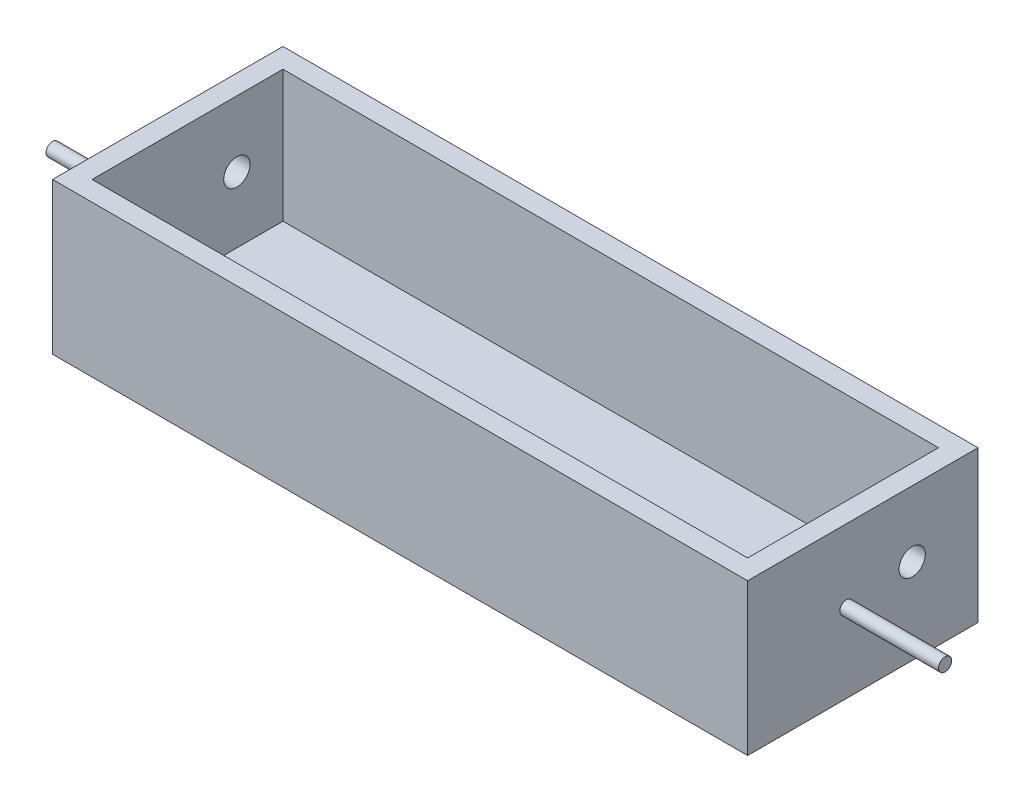
ISO-10303-21;
HEADER;
FILE_DESCRIPTION(('STEP AP214'),'2;1');
FILE_NAME('part.step','',(''),(''),'','','');
FILE_SCHEMA(('AUTOMOTIVE_DESIGN { 1 0 10303 214 1 1 1 1 }'));
ENDSEC;
DATA;
#1=APPLICATION_CONTEXT('core data for automotive mechanical design processes');
#2=APPLICATION_PROTOCOL_DEFINITION('international standard','automotive_design',2000,#1);
#3=PRODUCT_CONTEXT('',#1,'mechanical');
#4=PRODUCT('Part','Part','',(#3));
#5=PRODUCT_RELATED_PRODUCT_CATEGORY('part','',(#4));
#6=PRODUCT_DEFINITION_FORMATION('','',#4);
#7=PRODUCT_DEFINITION_CONTEXT('part definition',#1,'design');
#8=PRODUCT_DEFINITION('design','',#6,#7);
#9=PRODUCT_DEFINITION_SHAPE('','',#8);
#10=(LENGTH_UNIT() NAMED_UNIT(*) SI_UNIT(.MILLI.,.METRE.));
#11=(NAMED_UNIT(*) PLANE_ANGLE_UNIT() SI_UNIT($,.RADIAN.));
#12=(NAMED_UNIT(*) SI_UNIT($,.STERADIAN.) SOLID_ANGLE_UNIT());
#13=UNCERTAINTY_MEASURE_WITH_UNIT(LENGTH_MEASURE(1.E-05),#10,'distance_accuracy_value','');
#14=(GEOMETRIC_REPRESENTATION_CONTEXT(3) GLOBAL_UNCERTAINTY_ASSIGNED_CONTEXT((#13)) GLOBAL_UNIT_ASSIGNED_CONTEXT((#10,
#11,#12)) REPRESENTATION_CONTEXT('',''));
#15=CARTESIAN_POINT('',(0.,0.,0.));
#16=DIRECTION('',(0.,0.,1.));
#17=DIRECTION('',(1.,0.,0.));
#18=AXIS2_PLACEMENT_3D('',#15,#16,#17);
#19=CARTESIAN_POINT('',(52.8,3.,0.));
#20=DIRECTION('',(-1.,0.,0.));
#21=DIRECTION('',(0.,0.,1.));
#22=AXIS2_PLACEMENT_3D('',#19,#20,#21);
#23=PLANE('',#22);
#24=CARTESIAN_POINT('',(52.8,12.,10.));
#25=DIRECTION('',(-1.,0.,0.));
#26=DIRECTION('',(0.,0.,1.));
#27=AXIS2_PLACEMENT_3D('',#24,#25,#26);
#28=CIRCLE('',#27,1.);
#29=CARTESIAN_POINT('',(52.8,12.,11.));
#30=VERTEX_POINT('',#29);
#31=EDGE_CURVE('E197',#30,#30,#28,.T.);
#32=ORIENTED_EDGE('',*,*,#31,.T.);
#33=EDGE_LOOP('',(#32));
#34=FACE_BOUND('',#33,.T.);
#35=CARTESIAN_POINT('',(52.8,13.,0.));
#36=DIRECTION('',(-1.,0.,0.));
#37=DIRECTION('',(0.,0.,1.));
#38=AXIS2_PLACEMENT_3D('',#35,#36,#37);
#39=CIRCLE('',#38,2.);
#40=CARTESIAN_POINT('',(52.8,13.,2.));
#41=VERTEX_POINT('',#40);
#42=EDGE_CURVE('E112',#41,#41,#39,.T.);
#43=ORIENTED_EDGE('',*,*,#42,.T.);
#44=EDGE_LOOP('',(#43));
#45=FACE_BOUND('',#44,.T.);
#46=DIRECTION('',(0.,0.,-1.));
#47=VECTOR('',#46,1.);
#48=CARTESIAN_POINT('',(52.8,0.,0.));
#49=LINE('',#48,#47);
#50=CARTESIAN_POINT('',(52.8,0.,25.));
#51=VERTEX_POINT('',#50);
#52=CARTESIAN_POINT('',(52.8,0.,-9.99999999999999));
#53=VERTEX_POINT('',#52);
#54=EDGE_CURVE('E174',#51,#53,#49,.T.);
#55=ORIENTED_EDGE('',*,*,#54,.T.);
#56=DIRECTION('',(0.,-1.,0.));
#57=VECTOR('',#56,1.);
#58=CARTESIAN_POINT('',(52.8,3.,-9.99999999999999));
#59=LINE('',#58,#57);
#60=CARTESIAN_POINT('',(52.8,23.,-9.99999999999999));
#61=VERTEX_POINT('',#60);
#62=EDGE_CURVE('E48',#61,#53,#59,.T.);
#63=ORIENTED_EDGE('',*,*,#62,.F.);
#64=DIRECTION('',(0.,0.,-1.));
#65=VECTOR('',#64,1.);
#66=CARTESIAN_POINT('',(52.8,23.,9.99999999999999));
#67=LINE('',#66,#65);
#68=CARTESIAN_POINT('',(52.8,23.,25.));
#69=VERTEX_POINT('',#68);
#70=EDGE_CURVE('E166',#69,#61,#67,.T.);
#71=ORIENTED_EDGE('',*,*,#70,.F.);
#72=DIRECTION('',(0.,1.,0.));
#73=VECTOR('',#72,1.);
#74=CARTESIAN_POINT('',(52.8,0.,25.));
#75=LINE('',#74,#73);
#76=EDGE_CURVE('E135',#51,#69,#75,.T.);
#77=ORIENTED_EDGE('',*,*,#76,.F.);
#78=EDGE_LOOP('',(#55,#63,#71,#77));
#79=FACE_BOUND('',#78,.T.);
#80=ADVANCED_FACE('F40',(#34,#45,#79),#23,.F.);
#81=CARTESIAN_POINT('',(0.,3.,-10.));
#82=DIRECTION('',(0.,0.,-1.));
#83=DIRECTION('',(-1.,0.,0.));
#84=AXIS2_PLACEMENT_3D('',#81,#82,#83);
#85=PLANE('',#84);
#86=DIRECTION('',(1.,0.,0.));
#87=VECTOR('',#86,1.);
#88=CARTESIAN_POINT('',(0.,0.,-10.));
#89=LINE('',#88,#87);
#90=CARTESIAN_POINT('',(-52.8,0.,-10.));
#91=VERTEX_POINT('',#90);
#92=EDGE_CURVE('E177',#91,#53,#89,.T.);
#93=ORIENTED_EDGE('',*,*,#92,.F.);
#94=DIRECTION('',(0.,-1.,0.));
#95=VECTOR('',#94,1.);
#96=CARTESIAN_POINT('',(-52.8,3.,-10.));
#97=LINE('',#96,#95);
#98=CARTESIAN_POINT('',(-52.8,23.,-9.99999999999999));
#99=VERTEX_POINT('',#98);
#100=EDGE_CURVE('E183',#99,#91,#97,.T.);
#101=ORIENTED_EDGE('',*,*,#100,.F.);
#102=DIRECTION('',(-1.,0.,0.));
#103=VECTOR('',#102,1.);
#104=CARTESIAN_POINT('',(-52.8,23.,-9.99999999999999));
#105=LINE('',#104,#103);
#106=EDGE_CURVE('E169',#61,#99,#105,.T.);
#107=ORIENTED_EDGE('',*,*,#106,.F.);
#108=ORIENTED_EDGE('',*,*,#62,.T.);
#109=EDGE_LOOP('',(#93,#101,#107,#108));
#110=FACE_BOUND('',#109,.T.);
#111=ADVANCED_FACE('F226',(#110),#85,.T.);
#112=CARTESIAN_POINT('',(-52.8,3.,0.));
#113=DIRECTION('',(-1.,0.,0.));
#114=DIRECTION('',(0.,0.,1.));
#115=AXIS2_PLACEMENT_3D('',#112,#113,#114);
#116=PLANE('',#115);
#117=CARTESIAN_POINT('',(-52.8,12.,10.));
#118=DIRECTION('',(-1.,0.,0.));
#119=DIRECTION('',(0.,0.,1.));
#120=AXIS2_PLACEMENT_3D('',#117,#118,#119);
#121=CIRCLE('',#120,1.);
#122=CARTESIAN_POINT('',(-52.8,12.,11.));
#123=VERTEX_POINT('',#122);
#124=EDGE_CURVE('E11',#123,#123,#121,.T.);
#125=ORIENTED_EDGE('',*,*,#124,.F.);
#126=EDGE_LOOP('',(#125));
#127=FACE_BOUND('',#126,.T.);
#128=CARTESIAN_POINT('',(-52.8,13.,0.));
#129=DIRECTION('',(-1.,0.,0.));
#130=DIRECTION('',(0.,0.,1.));
#131=AXIS2_PLACEMENT_3D('',#128,#129,#130);
#132=CIRCLE('',#131,2.);
#133=CARTESIAN_POINT('',(-52.8,13.,2.));
#134=VERTEX_POINT('',#133);
#135=EDGE_CURVE('E144',#134,#134,#132,.T.);
#136=ORIENTED_EDGE('',*,*,#135,.F.);
#137=EDGE_LOOP('',(#136));
#138=FACE_BOUND('',#137,.T.);
#139=DIRECTION('',(0.,0.,-1.));
#140=VECTOR('',#139,1.);
#141=CARTESIAN_POINT('',(-52.8,0.,0.));
#142=LINE('',#141,#140);
#143=CARTESIAN_POINT('',(-52.8,0.,25.));
#144=VERTEX_POINT('',#143);
#145=EDGE_CURVE('E180',#144,#91,#142,.T.);
#146=ORIENTED_EDGE('',*,*,#145,.F.);
#147=DIRECTION('',(0.,1.,0.));
#148=VECTOR('',#147,1.);
#149=CARTESIAN_POINT('',(-52.8,0.,25.));
#150=LINE('',#149,#148);
#151=CARTESIAN_POINT('',(-52.8,23.,25.));
#152=VERTEX_POINT('',#151);
#153=EDGE_CURVE('E133',#144,#152,#150,.T.);
#154=ORIENTED_EDGE('',*,*,#153,.T.);
#155=DIRECTION('',(0.,0.,1.));
#156=VECTOR('',#155,1.);
#157=CARTESIAN_POINT('',(-52.8,23.,9.99999999999999));
#158=LINE('',#157,#156);
#159=EDGE_CURVE('E172',#99,#152,#158,.T.);
#160=ORIENTED_EDGE('',*,*,#159,.F.);
#161=ORIENTED_EDGE('',*,*,#100,.T.);
#162=EDGE_LOOP('',(#146,#154,#160,#161));
#163=FACE_BOUND('',#162,.T.);
#164=ADVANCED_FACE('F231',(#127,#138,#163),#116,.T.);
#165=CARTESIAN_POINT('',(0.,0.,0.));
#166=DIRECTION('',(0.,1.,0.));
#167=DIRECTION('',(0.,0.,1.));
#168=AXIS2_PLACEMENT_3D('',#165,#166,#167);
#169=PLANE('',#168);
#170=CARTESIAN_POINT('',(-37.5,0.,7.71986267166046));
#171=DIRECTION('',(0.,-1.,0.));
#172=DIRECTION('',(0.,0.,-1.));
#173=AXIS2_PLACEMENT_3D('',#170,#171,#172);
#174=CIRCLE('',#173,4.);
#175=CARTESIAN_POINT('',(-37.5,0.,3.71986267166046));
#176=VERTEX_POINT('',#175);
#177=EDGE_CURVE('E189',#176,#176,#174,.T.);
#178=ORIENTED_EDGE('',*,*,#177,.F.);
#179=EDGE_LOOP('',(#178));
#180=FACE_BOUND('',#179,.T.);
#181=CARTESIAN_POINT('',(37.5,0.,7.50000000000001));
#182=DIRECTION('',(0.,-1.,0.));
#183=DIRECTION('',(0.,0.,-1.));
#184=AXIS2_PLACEMENT_3D('',#181,#182,#183);
#185=CIRCLE('',#184,4.00000000000001);
#186=CARTESIAN_POINT('',(37.5,0.,3.5));
#187=VERTEX_POINT('',#186);
#188=EDGE_CURVE('E130',#187,#187,#185,.T.);
#189=ORIENTED_EDGE('',*,*,#188,.F.);
#190=EDGE_LOOP('',(#189));
#191=FACE_BOUND('',#190,.T.);
#192=ORIENTED_EDGE('',*,*,#54,.F.);
#193=DIRECTION('',(-1.,0.,0.));
#194=VECTOR('',#193,1.);
#195=CARTESIAN_POINT('',(52.8,0.,25.));
#196=LINE('',#195,#194);
#197=EDGE_CURVE('E138',#51,#144,#196,.T.);
#198=ORIENTED_EDGE('',*,*,#197,.T.);
#199=ORIENTED_EDGE('',*,*,#145,.T.);
#200=ORIENTED_EDGE('',*,*,#92,.T.);
#201=EDGE_LOOP('',(#192,#198,#199,#200));
#202=FACE_BOUND('',#201,.T.);
#203=ADVANCED_FACE('F242',(#180,#191,#202),#169,.F.);
#204=CARTESIAN_POINT('',(0.,23.,0.));
#205=DIRECTION('',(0.,-1.,0.));
#206=DIRECTION('',(0.,0.,-1.));
#207=AXIS2_PLACEMENT_3D('',#204,#205,#206);
#208=PLANE('',#207);
#209=ORIENTED_EDGE('',*,*,#70,.T.);
#210=ORIENTED_EDGE('',*,*,#106,.T.);
#211=ORIENTED_EDGE('',*,*,#159,.T.);
#212=DIRECTION('',(-1.,0.,0.));
#213=VECTOR('',#212,1.);
#214=CARTESIAN_POINT('',(52.8,23.,25.));
#215=LINE('',#214,#213);
#216=EDGE_CURVE('E141',#69,#152,#215,.T.);
#217=ORIENTED_EDGE('',*,*,#216,.F.);
#218=EDGE_LOOP('',(#209,#210,#211,#217));
#219=FACE_BOUND('',#218,.T.);
#220=DIRECTION('',(1.,0.,0.));
#221=VECTOR('',#220,1.);
#222=CARTESIAN_POINT('',(0.,23.,22.));
#223=LINE('',#222,#221);
#224=CARTESIAN_POINT('',(-49.8,23.,22.));
#225=VERTEX_POINT('',#224);
#226=CARTESIAN_POINT('',(49.8,23.,22.));
#227=VERTEX_POINT('',#226);
#228=EDGE_CURVE('E120',#225,#227,#223,.T.);
#229=ORIENTED_EDGE('',*,*,#228,.F.);
#230=DIRECTION('',(0.,0.,1.));
#231=VECTOR('',#230,1.);
#232=CARTESIAN_POINT('',(-49.8,23.,7.));
#233=LINE('',#232,#231);
#234=CARTESIAN_POINT('',(-49.8,23.,-7.));
#235=VERTEX_POINT('',#234);
#236=EDGE_CURVE('E159',#235,#225,#233,.T.);
#237=ORIENTED_EDGE('',*,*,#236,.F.);
#238=DIRECTION('',(-1.,0.,0.));
#239=VECTOR('',#238,1.);
#240=CARTESIAN_POINT('',(-49.8,23.,-7.));
#241=LINE('',#240,#239);
#242=CARTESIAN_POINT('',(49.8,23.,-7.));
#243=VERTEX_POINT('',#242);
#244=EDGE_CURVE('E157',#243,#235,#241,.T.);
#245=ORIENTED_EDGE('',*,*,#244,.F.);
#246=DIRECTION('',(0.,0.,-1.));
#247=VECTOR('',#246,1.);
#248=CARTESIAN_POINT('',(49.8,23.,7.));
#249=LINE('',#248,#247);
#250=EDGE_CURVE('E155',#227,#243,#249,.T.);
#251=ORIENTED_EDGE('',*,*,#250,.F.);
#252=EDGE_LOOP('',(#229,#237,#245,#251));
#253=FACE_BOUND('',#252,.T.);
#254=ADVANCED_FACE('F246',(#219,#253),#208,.F.);
#255=CARTESIAN_POINT('',(49.8,23.,7.));
#256=DIRECTION('',(-1.,0.,0.));
#257=DIRECTION('',(0.,0.,1.));
#258=AXIS2_PLACEMENT_3D('',#255,#256,#257);
#259=PLANE('',#258);
#260=CARTESIAN_POINT('',(49.8,13.,0.));
#261=DIRECTION('',(-1.,0.,0.));
#262=DIRECTION('',(0.,0.,1.));
#263=AXIS2_PLACEMENT_3D('',#260,#261,#262);
#264=CIRCLE('',#263,2.);
#265=CARTESIAN_POINT('',(49.8,13.,2.));
#266=VERTEX_POINT('',#265);
#267=EDGE_CURVE('E150',#266,#266,#264,.T.);
#268=ORIENTED_EDGE('',*,*,#267,.F.);
#269=EDGE_LOOP('',(#268));
#270=FACE_BOUND('',#269,.T.);
#271=DIRECTION('',(0.,1.,0.));
#272=VECTOR('',#271,1.);
#273=CARTESIAN_POINT('',(49.8,3.,22.));
#274=LINE('',#273,#272);
#275=CARTESIAN_POINT('',(49.8,3.,22.));
#276=VERTEX_POINT('',#275);
#277=EDGE_CURVE('E107',#276,#227,#274,.T.);
#278=ORIENTED_EDGE('',*,*,#277,.T.);
#279=ORIENTED_EDGE('',*,*,#250,.T.);
#280=DIRECTION('',(0.,-1.,0.));
#281=VECTOR('',#280,1.);
#282=CARTESIAN_POINT('',(49.8,23.,-7.));
#283=LINE('',#282,#281);
#284=CARTESIAN_POINT('',(49.8,3.,-7.));
#285=VERTEX_POINT('',#284);
#286=EDGE_CURVE('E56',#243,#285,#283,.T.);
#287=ORIENTED_EDGE('',*,*,#286,.T.);
#288=DIRECTION('',(0.,0.,-1.));
#289=VECTOR('',#288,1.);
#290=CARTESIAN_POINT('',(49.8,3.,7.));
#291=LINE('',#290,#289);
#292=EDGE_CURVE('E104',#276,#285,#291,.T.);
#293=ORIENTED_EDGE('',*,*,#292,.F.);
#294=EDGE_LOOP('',(#278,#279,#287,#293));
#295=FACE_BOUND('',#294,.T.);
#296=ADVANCED_FACE('F106',(#270,#295),#259,.T.);
#297=CARTESIAN_POINT('',(-49.8,23.,-7.));
#298=DIRECTION('',(0.,0.,1.));
#299=DIRECTION('',(1.,0.,0.));
#300=AXIS2_PLACEMENT_3D('',#297,#298,#299);
#301=PLANE('',#300);
#302=DIRECTION('',(0.,-1.,0.));
#303=VECTOR('',#302,1.);
#304=CARTESIAN_POINT('',(-49.8,23.,-7.));
#305=LINE('',#304,#303);
#306=CARTESIAN_POINT('',(-49.8,3.,-7.));
#307=VERTEX_POINT('',#306);
#308=EDGE_CURVE('E64',#235,#307,#305,.T.);
#309=ORIENTED_EDGE('',*,*,#308,.T.);
#310=DIRECTION('',(-1.,0.,0.));
#311=VECTOR('',#310,1.);
#312=CARTESIAN_POINT('',(-49.8,3.,-7.));
#313=LINE('',#312,#311);
#314=EDGE_CURVE('E111',#285,#307,#313,.T.);
#315=ORIENTED_EDGE('',*,*,#314,.F.);
#316=ORIENTED_EDGE('',*,*,#286,.F.);
#317=ORIENTED_EDGE('',*,*,#244,.T.);
#318=EDGE_LOOP('',(#309,#315,#316,#317));
#319=FACE_BOUND('',#318,.T.);
#320=ADVANCED_FACE('F272',(#319),#301,.T.);
#321=CARTESIAN_POINT('',(-49.8,23.,7.));
#322=DIRECTION('',(1.,0.,0.));
#323=DIRECTION('',(0.,0.,-1.));
#324=AXIS2_PLACEMENT_3D('',#321,#322,#323);
#325=PLANE('',#324);
#326=CARTESIAN_POINT('',(-49.8,13.,0.));
#327=DIRECTION('',(1.,0.,0.));
#328=DIRECTION('',(0.,0.,-1.));
#329=AXIS2_PLACEMENT_3D('',#326,#327,#328);
#330=CIRCLE('',#329,2.);
#331=CARTESIAN_POINT('',(-49.8,13.,-2.));
#332=VERTEX_POINT('',#331);
#333=EDGE_CURVE('E149',#332,#332,#330,.T.);
#334=ORIENTED_EDGE('',*,*,#333,.F.);
#335=EDGE_LOOP('',(#334));
#336=FACE_BOUND('',#335,.T.);
#337=DIRECTION('',(0.,0.,1.));
#338=VECTOR('',#337,1.);
#339=CARTESIAN_POINT('',(-49.8,3.,7.));
#340=LINE('',#339,#338);
#341=CARTESIAN_POINT('',(-49.8,3.,22.));
#342=VERTEX_POINT('',#341);
#343=EDGE_CURVE('E125',#307,#342,#340,.T.);
#344=ORIENTED_EDGE('',*,*,#343,.F.);
#345=ORIENTED_EDGE('',*,*,#308,.F.);
#346=ORIENTED_EDGE('',*,*,#236,.T.);
#347=DIRECTION('',(0.,1.,0.));
#348=VECTOR('',#347,1.);
#349=CARTESIAN_POINT('',(-49.8,3.,22.));
#350=LINE('',#349,#348);
#351=EDGE_CURVE('E121',#342,#225,#350,.T.);
#352=ORIENTED_EDGE('',*,*,#351,.F.);
#353=EDGE_LOOP('',(#344,#345,#346,#352));
#354=FACE_BOUND('',#353,.T.);
#355=ADVANCED_FACE('F266',(#336,#354),#325,.T.);
#356=CARTESIAN_POINT('',(0.,3.,0.));
#357=DIRECTION('',(0.,1.,0.));
#358=DIRECTION('',(0.,0.,1.));
#359=AXIS2_PLACEMENT_3D('',#356,#357,#358);
#360=PLANE('',#359);
#361=CARTESIAN_POINT('',(-37.5,3.,7.71986267166046));
#362=DIRECTION('',(0.,1.,0.));
#363=DIRECTION('',(0.,0.,1.));
#364=AXIS2_PLACEMENT_3D('',#361,#362,#363);
#365=CIRCLE('',#364,4.);
#366=CARTESIAN_POINT('',(-37.5,3.,11.7198626716605));
#367=VERTEX_POINT('',#366);
#368=EDGE_CURVE('E43',#367,#367,#365,.T.);
#369=ORIENTED_EDGE('',*,*,#368,.F.);
#370=EDGE_LOOP('',(#369));
#371=FACE_BOUND('',#370,.T.);
#372=CARTESIAN_POINT('',(37.5,3.,7.50000000000001));
#373=DIRECTION('',(0.,1.,0.));
#374=DIRECTION('',(0.,0.,1.));
#375=AXIS2_PLACEMENT_3D('',#372,#373,#374);
#376=CIRCLE('',#375,4.00000000000001);
#377=CARTESIAN_POINT('',(37.5,3.,11.5));
#378=VERTEX_POINT('',#377);
#379=EDGE_CURVE('E187',#378,#378,#376,.T.);
#380=ORIENTED_EDGE('',*,*,#379,.F.);
#381=EDGE_LOOP('',(#380));
#382=FACE_BOUND('',#381,.T.);
#383=ORIENTED_EDGE('',*,*,#292,.T.);
#384=ORIENTED_EDGE('',*,*,#314,.T.);
#385=ORIENTED_EDGE('',*,*,#343,.T.);
#386=DIRECTION('',(1.,0.,0.));
#387=VECTOR('',#386,1.);
#388=CARTESIAN_POINT('',(0.,3.,22.));
#389=LINE('',#388,#387);
#390=EDGE_CURVE('E118',#342,#276,#389,.T.);
#391=ORIENTED_EDGE('',*,*,#390,.T.);
#392=EDGE_LOOP('',(#383,#384,#385,#391));
#393=FACE_BOUND('',#392,.T.);
#394=ADVANCED_FACE('F123',(#371,#382,#393),#360,.T.);
#395=CARTESIAN_POINT('',(57.2,13.,0.));
#396=DIRECTION('',(-1.,0.,0.));
#397=DIRECTION('',(0.,0.,1.));
#398=AXIS2_PLACEMENT_3D('',#395,#396,#397);
#399=CYLINDRICAL_SURFACE('',#398,2.);
#400=ORIENTED_EDGE('',*,*,#333,.T.);
#401=EDGE_LOOP('',(#400));
#402=FACE_BOUND('',#401,.T.);
#403=ORIENTED_EDGE('',*,*,#135,.T.);
#404=EDGE_LOOP('',(#403));
#405=FACE_BOUND('',#404,.T.);
#406=ADVANCED_FACE('F265',(#402,#405),#399,.F.);
#407=ORIENTED_EDGE('',*,*,#267,.T.);
#408=EDGE_LOOP('',(#407));
#409=FACE_BOUND('',#408,.T.);
#410=ORIENTED_EDGE('',*,*,#42,.F.);
#411=EDGE_LOOP('',(#410));
#412=FACE_BOUND('',#411,.T.);
#413=ADVANCED_FACE('F281',(#409,#412),#399,.F.);
#414=CARTESIAN_POINT('',(52.8,0.,25.));
#415=DIRECTION('',(0.,0.,1.));
#416=DIRECTION('',(1.,0.,0.));
#417=AXIS2_PLACEMENT_3D('',#414,#415,#416);
#418=PLANE('',#417);
#419=ORIENTED_EDGE('',*,*,#153,.F.);
#420=ORIENTED_EDGE('',*,*,#197,.F.);
#421=ORIENTED_EDGE('',*,*,#76,.T.);
#422=ORIENTED_EDGE('',*,*,#216,.T.);
#423=EDGE_LOOP('',(#419,#420,#421,#422));
#424=FACE_BOUND('',#423,.T.);
#425=ADVANCED_FACE('F250',(#424),#418,.T.);
#426=CARTESIAN_POINT('',(0.,3.,22.));
#427=DIRECTION('',(0.,0.,1.));
#428=DIRECTION('',(1.,0.,0.));
#429=AXIS2_PLACEMENT_3D('',#426,#427,#428);
#430=PLANE('',#429);
#431=ORIENTED_EDGE('',*,*,#228,.T.);
#432=ORIENTED_EDGE('',*,*,#277,.F.);
#433=ORIENTED_EDGE('',*,*,#390,.F.);
#434=ORIENTED_EDGE('',*,*,#351,.T.);
#435=EDGE_LOOP('',(#431,#432,#433,#434));
#436=FACE_BOUND('',#435,.T.);
#437=ADVANCED_FACE('F117',(#436),#430,.F.);
#438=CARTESIAN_POINT('',(37.5,20.,7.50000000000001));
#439=DIRECTION('',(0.,-1.,0.));
#440=DIRECTION('',(0.,0.,-1.));
#441=AXIS2_PLACEMENT_3D('',#438,#439,#440);
#442=CYLINDRICAL_SURFACE('',#441,4.00000000000001);
#443=ORIENTED_EDGE('',*,*,#379,.T.);
#444=EDGE_LOOP('',(#443));
#445=FACE_BOUND('',#444,.T.);
#446=ORIENTED_EDGE('',*,*,#188,.T.);
#447=EDGE_LOOP('',(#446));
#448=FACE_BOUND('',#447,.T.);
#449=ADVANCED_FACE('F287',(#445,#448),#442,.F.);
#450=CARTESIAN_POINT('',(-37.5,20.,7.71986267166046));
#451=DIRECTION('',(0.,-1.,0.));
#452=DIRECTION('',(0.,0.,-1.));
#453=AXIS2_PLACEMENT_3D('',#450,#451,#452);
#454=CYLINDRICAL_SURFACE('',#453,4.);
#455=ORIENTED_EDGE('',*,*,#368,.T.);
#456=EDGE_LOOP('',(#455));
#457=FACE_BOUND('',#456,.T.);
#458=ORIENTED_EDGE('',*,*,#177,.T.);
#459=EDGE_LOOP('',(#458));
#460=FACE_BOUND('',#459,.T.);
#461=ADVANCED_FACE('F221',(#457,#460),#454,.F.);
#462=CARTESIAN_POINT('',(-67.8,0.,0.));
#463=DIRECTION('',(-1.,0.,0.));
#464=DIRECTION('',(0.,0.,1.));
#465=AXIS2_PLACEMENT_3D('',#462,#463,#464);
#466=PLANE('',#465);
#467=CARTESIAN_POINT('',(-67.8,12.,10.));
#468=DIRECTION('',(-1.,0.,0.));
#469=DIRECTION('',(0.,0.,1.));
#470=AXIS2_PLACEMENT_3D('',#467,#468,#469);
#471=CIRCLE('',#470,1.);
#472=CARTESIAN_POINT('',(-67.8,12.,11.));
#473=VERTEX_POINT('',#472);
#474=EDGE_CURVE('E204',#473,#473,#471,.T.);
#475=ORIENTED_EDGE('',*,*,#474,.T.);
#476=EDGE_LOOP('',(#475));
#477=FACE_BOUND('',#476,.T.);
#478=ADVANCED_FACE('F208',(#477),#466,.T.);
#479=CARTESIAN_POINT('',(67.8,12.,10.));
#480=DIRECTION('',(-1.,0.,0.));
#481=DIRECTION('',(0.,0.,1.));
#482=AXIS2_PLACEMENT_3D('',#479,#480,#481);
#483=CYLINDRICAL_SURFACE('',#482,1.);
#484=ORIENTED_EDGE('',*,*,#124,.T.);
#485=EDGE_LOOP('',(#484));
#486=FACE_BOUND('',#485,.T.);
#487=ORIENTED_EDGE('',*,*,#474,.F.);
#488=EDGE_LOOP('',(#487));
#489=FACE_BOUND('',#488,.T.);
#490=ADVANCED_FACE('F210',(#486,#489),#483,.T.);
#491=CARTESIAN_POINT('',(67.8,12.,10.));
#492=DIRECTION('',(-1.,0.,0.));
#493=DIRECTION('',(0.,0.,1.));
#494=AXIS2_PLACEMENT_3D('',#491,#492,#493);
#495=CIRCLE('',#494,1.);
#496=CARTESIAN_POINT('',(67.8,12.,11.));
#497=VERTEX_POINT('',#496);
#498=EDGE_CURVE('E200',#497,#497,#495,.T.);
#499=ORIENTED_EDGE('',*,*,#498,.T.);
#500=EDGE_LOOP('',(#499));
#501=FACE_BOUND('',#500,.T.);
#502=ORIENTED_EDGE('',*,*,#31,.F.);
#503=EDGE_LOOP('',(#502));
#504=FACE_BOUND('',#503,.T.);
#505=ADVANCED_FACE('F212',(#501,#504),#483,.T.);
#506=CARTESIAN_POINT('',(67.8,0.,0.));
#507=DIRECTION('',(-1.,0.,0.));
#508=DIRECTION('',(0.,0.,1.));
#509=AXIS2_PLACEMENT_3D('',#506,#507,#508);
#510=PLANE('',#509);
#511=ORIENTED_EDGE('',*,*,#498,.F.);
#512=EDGE_LOOP('',(#511));
#513=FACE_BOUND('',#512,.T.);
#514=ADVANCED_FACE('F219',(#513),#510,.F.);
#515=CLOSED_SHELL('',(#80,#111,#164,#203,#254,#296,#320,#355,#394,#406,#413,#425,#437,#449,#461,
#478,#490,#505,#514));
#516=MANIFOLD_SOLID_BREP('B2',#515);
#517=ADVANCED_BREP_SHAPE_REPRESENTATION('',(#18,#516),#14);
#518=SHAPE_DEFINITION_REPRESENTATION(#9,#517);
ENDSEC;
END-ISO-10303-21;
